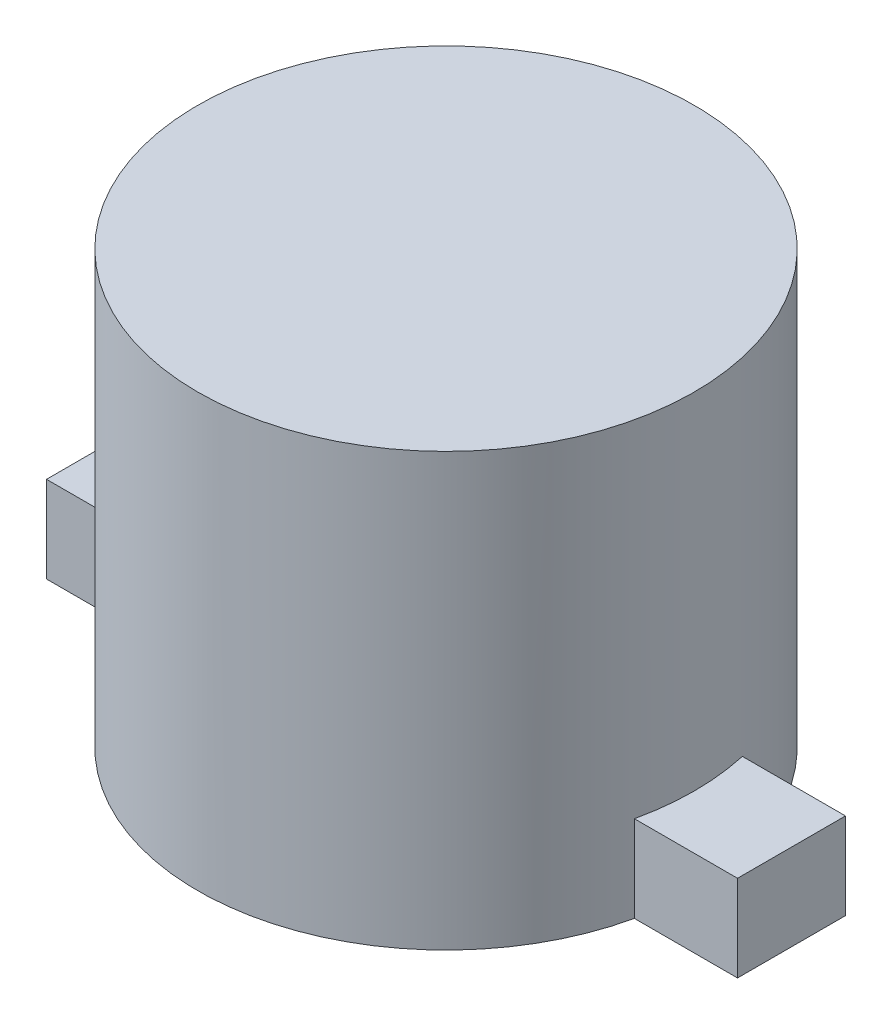
ISO-10303-21;
HEADER;
FILE_DESCRIPTION(('STEP AP214'),'2;1');
FILE_NAME('part.step','',(''),(''),'','','');
FILE_SCHEMA(('AUTOMOTIVE_DESIGN { 1 0 10303 214 1 1 1 1 }'));
ENDSEC;
DATA;
#1=APPLICATION_CONTEXT('core data for automotive mechanical design processes');
#2=APPLICATION_PROTOCOL_DEFINITION('international standard','automotive_design',2000,#1);
#3=PRODUCT_CONTEXT('',#1,'mechanical');
#4=PRODUCT('Part','Part','',(#3));
#5=PRODUCT_RELATED_PRODUCT_CATEGORY('part','',(#4));
#6=PRODUCT_DEFINITION_FORMATION('','',#4);
#7=PRODUCT_DEFINITION_CONTEXT('part definition',#1,'design');
#8=PRODUCT_DEFINITION('design','',#6,#7);
#9=PRODUCT_DEFINITION_SHAPE('','',#8);
#10=(LENGTH_UNIT() NAMED_UNIT(*) SI_UNIT(.MILLI.,.METRE.));
#11=(NAMED_UNIT(*) PLANE_ANGLE_UNIT() SI_UNIT($,.RADIAN.));
#12=(NAMED_UNIT(*) SI_UNIT($,.STERADIAN.) SOLID_ANGLE_UNIT());
#13=UNCERTAINTY_MEASURE_WITH_UNIT(LENGTH_MEASURE(1.E-05),#10,'distance_accuracy_value','');
#14=(GEOMETRIC_REPRESENTATION_CONTEXT(3) GLOBAL_UNCERTAINTY_ASSIGNED_CONTEXT((#13)) GLOBAL_UNIT_ASSIGNED_CONTEXT((#10,
#11,#12)) REPRESENTATION_CONTEXT('',''));
#15=CARTESIAN_POINT('',(0.,0.,0.));
#16=DIRECTION('',(0.,0.,1.));
#17=DIRECTION('',(1.,0.,0.));
#18=AXIS2_PLACEMENT_3D('',#15,#16,#17);
#19=CARTESIAN_POINT('',(0.,10.,0.));
#20=DIRECTION('',(0.,-1.,0.));
#21=DIRECTION('',(0.,0.,-1.));
#22=AXIS2_PLACEMENT_3D('',#19,#20,#21);
#23=CYLINDRICAL_SURFACE('',#22,5.75000000000001);
#24=CARTESIAN_POINT('',(0.,2.,0.));
#25=DIRECTION('',(0.,-1.,0.));
#26=DIRECTION('',(0.,0.,-1.));
#27=AXIS2_PLACEMENT_3D('',#24,#25,#26);
#28=CIRCLE('',#27,5.75000000000001);
#29=CARTESIAN_POINT('',(5.61248608016092,2.,-1.25));
#30=VERTEX_POINT('',#29);
#31=CARTESIAN_POINT('',(5.61248608016092,2.,1.25));
#32=VERTEX_POINT('',#31);
#33=EDGE_CURVE('E11',#30,#32,#28,.T.);
#34=ORIENTED_EDGE('',*,*,#33,.F.);
#35=DIRECTION('',(0.,-1.,0.));
#36=VECTOR('',#35,1.);
#37=CARTESIAN_POINT('',(5.61248608016092,10.,-1.25));
#38=LINE('',#37,#36);
#39=CARTESIAN_POINT('',(5.61248608016092,0.,-1.25));
#40=VERTEX_POINT('',#39);
#41=EDGE_CURVE('E177',#30,#40,#38,.T.);
#42=ORIENTED_EDGE('',*,*,#41,.T.);
#43=CARTESIAN_POINT('',(0.,0.,0.));
#44=DIRECTION('',(0.,1.,0.));
#45=DIRECTION('',(0.,0.,1.));
#46=AXIS2_PLACEMENT_3D('',#43,#44,#45);
#47=CIRCLE('',#46,5.75000000000001);
#48=CARTESIAN_POINT('',(-5.61248608016092,0.,-1.25));
#49=VERTEX_POINT('',#48);
#50=EDGE_CURVE('E184',#40,#49,#47,.T.);
#51=ORIENTED_EDGE('',*,*,#50,.T.);
#52=DIRECTION('',(0.,-1.,0.));
#53=VECTOR('',#52,1.);
#54=CARTESIAN_POINT('',(-5.61248608016092,10.,-1.25));
#55=LINE('',#54,#53);
#56=CARTESIAN_POINT('',(-5.61248608016092,2.,-1.25));
#57=VERTEX_POINT('',#56);
#58=EDGE_CURVE('E174',#49,#57,#55,.F.);
#59=ORIENTED_EDGE('',*,*,#58,.T.);
#60=CARTESIAN_POINT('',(-5.61248608016092,2.,1.25));
#61=VERTEX_POINT('',#60);
#62=EDGE_CURVE('E48',#61,#57,#28,.T.);
#63=ORIENTED_EDGE('',*,*,#62,.F.);
#64=DIRECTION('',(0.,-1.,0.));
#65=VECTOR('',#64,1.);
#66=CARTESIAN_POINT('',(-5.61248608016092,10.,1.25));
#67=LINE('',#66,#65);
#68=CARTESIAN_POINT('',(-5.61248608016092,0.,1.25));
#69=VERTEX_POINT('',#68);
#70=EDGE_CURVE('E170',#61,#69,#67,.T.);
#71=ORIENTED_EDGE('',*,*,#70,.T.);
#72=CARTESIAN_POINT('',(5.61248608016092,0.,1.25));
#73=VERTEX_POINT('',#72);
#74=EDGE_CURVE('E180',#69,#73,#47,.T.);
#75=ORIENTED_EDGE('',*,*,#74,.T.);
#76=DIRECTION('',(0.,-1.,0.));
#77=VECTOR('',#76,1.);
#78=CARTESIAN_POINT('',(5.61248608016092,10.,1.25));
#79=LINE('',#78,#77);
#80=EDGE_CURVE('E60',#73,#32,#79,.F.);
#81=ORIENTED_EDGE('',*,*,#80,.T.);
#82=EDGE_LOOP('',(#34,#42,#51,#59,#63,#71,#75,#81));
#83=FACE_BOUND('',#82,.T.);
#84=CARTESIAN_POINT('',(0.,10.,0.));
#85=DIRECTION('',(0.,1.,0.));
#86=DIRECTION('',(0.,0.,1.));
#87=AXIS2_PLACEMENT_3D('',#84,#85,#86);
#88=CIRCLE('',#87,5.75000000000001);
#89=CARTESIAN_POINT('',(0.,10.,5.75000000000001));
#90=VERTEX_POINT('',#89);
#91=EDGE_CURVE('E181',#90,#90,#88,.T.);
#92=ORIENTED_EDGE('',*,*,#91,.F.);
#93=EDGE_LOOP('',(#92));
#94=FACE_BOUND('',#93,.T.);
#95=ADVANCED_FACE('F45',(#83,#94),#23,.T.);
#96=CARTESIAN_POINT('',(0.,10.,0.));
#97=DIRECTION('',(0.,1.,0.));
#98=DIRECTION('',(0.,0.,1.));
#99=AXIS2_PLACEMENT_3D('',#96,#97,#98);
#100=PLANE('',#99);
#101=ORIENTED_EDGE('',*,*,#91,.T.);
#102=EDGE_LOOP('',(#101));
#103=FACE_BOUND('',#102,.T.);
#104=ADVANCED_FACE('F226',(#103),#100,.T.);
#105=CARTESIAN_POINT('',(0.,0.,0.));
#106=DIRECTION('',(0.,1.,0.));
#107=DIRECTION('',(0.,0.,1.));
#108=AXIS2_PLACEMENT_3D('',#105,#106,#107);
#109=PLANE('',#108);
#110=ORIENTED_EDGE('',*,*,#74,.F.);
#111=DIRECTION('',(-1.,0.,0.));
#112=VECTOR('',#111,1.);
#113=CARTESIAN_POINT('',(-8.,0.,1.25));
#114=LINE('',#113,#112);
#115=CARTESIAN_POINT('',(-8.,0.,1.25));
#116=VERTEX_POINT('',#115);
#117=EDGE_CURVE('E153',#69,#116,#114,.T.);
#118=ORIENTED_EDGE('',*,*,#117,.T.);
#119=DIRECTION('',(0.,0.,-1.));
#120=VECTOR('',#119,1.);
#121=CARTESIAN_POINT('',(-8.,0.,1.25));
#122=LINE('',#121,#120);
#123=CARTESIAN_POINT('',(-8.,0.,-1.25));
#124=VERTEX_POINT('',#123);
#125=EDGE_CURVE('E156',#116,#124,#122,.T.);
#126=ORIENTED_EDGE('',*,*,#125,.T.);
#127=DIRECTION('',(1.,0.,0.));
#128=VECTOR('',#127,1.);
#129=CARTESIAN_POINT('',(-8.,0.,-1.25));
#130=LINE('',#129,#128);
#131=EDGE_CURVE('E135',#124,#49,#130,.T.);
#132=ORIENTED_EDGE('',*,*,#131,.T.);
#133=ORIENTED_EDGE('',*,*,#50,.F.);
#134=CARTESIAN_POINT('',(8.,0.,-1.25));
#135=VERTEX_POINT('',#134);
#136=EDGE_CURVE('E140',#40,#135,#130,.T.);
#137=ORIENTED_EDGE('',*,*,#136,.T.);
#138=DIRECTION('',(0.,0.,1.));
#139=VECTOR('',#138,1.);
#140=CARTESIAN_POINT('',(8.,0.,1.25));
#141=LINE('',#140,#139);
#142=CARTESIAN_POINT('',(8.,0.,1.25));
#143=VERTEX_POINT('',#142);
#144=EDGE_CURVE('E150',#135,#143,#141,.T.);
#145=ORIENTED_EDGE('',*,*,#144,.T.);
#146=EDGE_CURVE('E112',#143,#73,#114,.T.);
#147=ORIENTED_EDGE('',*,*,#146,.T.);
#148=EDGE_LOOP('',(#110,#118,#126,#132,#133,#137,#145,#147));
#149=FACE_BOUND('',#148,.T.);
#150=ADVANCED_FACE('F196',(#149),#109,.F.);
#151=CARTESIAN_POINT('',(-8.,2.,1.25));
#152=DIRECTION('',(-1.,0.,0.));
#153=DIRECTION('',(0.,0.,1.));
#154=AXIS2_PLACEMENT_3D('',#151,#152,#153);
#155=PLANE('',#154);
#156=ORIENTED_EDGE('',*,*,#125,.F.);
#157=DIRECTION('',(0.,-1.,0.));
#158=VECTOR('',#157,1.);
#159=CARTESIAN_POINT('',(-8.,2.,1.25));
#160=LINE('',#159,#158);
#161=CARTESIAN_POINT('',(-8.,2.,1.25));
#162=VERTEX_POINT('',#161);
#163=EDGE_CURVE('E118',#162,#116,#160,.T.);
#164=ORIENTED_EDGE('',*,*,#163,.F.);
#165=DIRECTION('',(0.,0.,-1.));
#166=VECTOR('',#165,1.);
#167=CARTESIAN_POINT('',(-8.,2.,1.25));
#168=LINE('',#167,#166);
#169=CARTESIAN_POINT('',(-8.,2.,-1.25));
#170=VERTEX_POINT('',#169);
#171=EDGE_CURVE('E127',#162,#170,#168,.T.);
#172=ORIENTED_EDGE('',*,*,#171,.T.);
#173=DIRECTION('',(0.,-1.,0.));
#174=VECTOR('',#173,1.);
#175=CARTESIAN_POINT('',(-8.,2.,-1.25));
#176=LINE('',#175,#174);
#177=EDGE_CURVE('E162',#170,#124,#176,.T.);
#178=ORIENTED_EDGE('',*,*,#177,.T.);
#179=EDGE_LOOP('',(#156,#164,#172,#178));
#180=FACE_BOUND('',#179,.T.);
#181=ADVANCED_FACE('F201',(#180),#155,.T.);
#182=CARTESIAN_POINT('',(0.,2.,0.));
#183=DIRECTION('',(0.,-1.,0.));
#184=DIRECTION('',(0.,0.,-1.));
#185=AXIS2_PLACEMENT_3D('',#182,#183,#184);
#186=PLANE('',#185);
#187=DIRECTION('',(-1.,0.,0.));
#188=VECTOR('',#187,1.);
#189=CARTESIAN_POINT('',(-8.,2.,1.25));
#190=LINE('',#189,#188);
#191=EDGE_CURVE('E128',#61,#162,#190,.T.);
#192=ORIENTED_EDGE('',*,*,#191,.F.);
#193=ORIENTED_EDGE('',*,*,#62,.T.);
#194=DIRECTION('',(1.,0.,0.));
#195=VECTOR('',#194,1.);
#196=CARTESIAN_POINT('',(-8.,2.,-1.25));
#197=LINE('',#196,#195);
#198=EDGE_CURVE('E119',#170,#57,#197,.T.);
#199=ORIENTED_EDGE('',*,*,#198,.F.);
#200=ORIENTED_EDGE('',*,*,#171,.F.);
#201=EDGE_LOOP('',(#192,#193,#199,#200));
#202=FACE_BOUND('',#201,.T.);
#203=ADVANCED_FACE('F205',(#202),#186,.F.);
#204=CARTESIAN_POINT('',(-8.,2.,1.25));
#205=DIRECTION('',(0.,0.,1.));
#206=DIRECTION('',(1.,0.,0.));
#207=AXIS2_PLACEMENT_3D('',#204,#205,#206);
#208=PLANE('',#207);
#209=ORIENTED_EDGE('',*,*,#70,.F.);
#210=ORIENTED_EDGE('',*,*,#191,.T.);
#211=ORIENTED_EDGE('',*,*,#163,.T.);
#212=ORIENTED_EDGE('',*,*,#117,.F.);
#213=EDGE_LOOP('',(#209,#210,#211,#212));
#214=FACE_BOUND('',#213,.T.);
#215=ADVANCED_FACE('F209',(#214),#208,.T.);
#216=CARTESIAN_POINT('',(-8.,2.,-1.25));
#217=DIRECTION('',(0.,0.,-1.));
#218=DIRECTION('',(-1.,0.,0.));
#219=AXIS2_PLACEMENT_3D('',#216,#217,#218);
#220=PLANE('',#219);
#221=ORIENTED_EDGE('',*,*,#58,.F.);
#222=ORIENTED_EDGE('',*,*,#131,.F.);
#223=ORIENTED_EDGE('',*,*,#177,.F.);
#224=ORIENTED_EDGE('',*,*,#198,.T.);
#225=EDGE_LOOP('',(#221,#222,#223,#224));
#226=FACE_BOUND('',#225,.T.);
#227=ADVANCED_FACE('F194',(#226),#220,.T.);
#228=CARTESIAN_POINT('',(8.,2.,-1.25));
#229=VERTEX_POINT('',#228);
#230=EDGE_CURVE('E146',#30,#229,#197,.T.);
#231=ORIENTED_EDGE('',*,*,#230,.F.);
#232=ORIENTED_EDGE('',*,*,#33,.T.);
#233=CARTESIAN_POINT('',(8.,2.,1.25));
#234=VERTEX_POINT('',#233);
#235=EDGE_CURVE('E110',#234,#32,#190,.T.);
#236=ORIENTED_EDGE('',*,*,#235,.F.);
#237=DIRECTION('',(0.,0.,1.));
#238=VECTOR('',#237,1.);
#239=CARTESIAN_POINT('',(8.,2.,1.25));
#240=LINE('',#239,#238);
#241=EDGE_CURVE('E125',#229,#234,#240,.T.);
#242=ORIENTED_EDGE('',*,*,#241,.F.);
#243=EDGE_LOOP('',(#231,#232,#236,#242));
#244=FACE_BOUND('',#243,.T.);
#245=ADVANCED_FACE('F124',(#244),#186,.F.);
#246=ORIENTED_EDGE('',*,*,#41,.F.);
#247=ORIENTED_EDGE('',*,*,#230,.T.);
#248=DIRECTION('',(0.,-1.,0.));
#249=VECTOR('',#248,1.);
#250=CARTESIAN_POINT('',(8.,2.,-1.25));
#251=LINE('',#250,#249);
#252=EDGE_CURVE('E133',#229,#135,#251,.T.);
#253=ORIENTED_EDGE('',*,*,#252,.T.);
#254=ORIENTED_EDGE('',*,*,#136,.F.);
#255=EDGE_LOOP('',(#246,#247,#253,#254));
#256=FACE_BOUND('',#255,.T.);
#257=ADVANCED_FACE('F213',(#256),#220,.T.);
#258=ORIENTED_EDGE('',*,*,#80,.F.);
#259=ORIENTED_EDGE('',*,*,#146,.F.);
#260=DIRECTION('',(0.,-1.,0.));
#261=VECTOR('',#260,1.);
#262=CARTESIAN_POINT('',(8.,2.,1.25));
#263=LINE('',#262,#261);
#264=EDGE_CURVE('E107',#234,#143,#263,.T.);
#265=ORIENTED_EDGE('',*,*,#264,.F.);
#266=ORIENTED_EDGE('',*,*,#235,.T.);
#267=EDGE_LOOP('',(#258,#259,#265,#266));
#268=FACE_BOUND('',#267,.T.);
#269=ADVANCED_FACE('F109',(#268),#208,.T.);
#270=CARTESIAN_POINT('',(8.,2.,1.25));
#271=DIRECTION('',(1.,0.,0.));
#272=DIRECTION('',(0.,0.,-1.));
#273=AXIS2_PLACEMENT_3D('',#270,#271,#272);
#274=PLANE('',#273);
#275=ORIENTED_EDGE('',*,*,#144,.F.);
#276=ORIENTED_EDGE('',*,*,#252,.F.);
#277=ORIENTED_EDGE('',*,*,#241,.T.);
#278=ORIENTED_EDGE('',*,*,#264,.T.);
#279=EDGE_LOOP('',(#275,#276,#277,#278));
#280=FACE_BOUND('',#279,.T.);
#281=ADVANCED_FACE('F131',(#280),#274,.T.);
#282=CLOSED_SHELL('',(#95,#104,#150,#181,#203,#215,#227,#245,#257,#269,#281));
#283=MANIFOLD_SOLID_BREP('B2',#282);
#284=ADVANCED_BREP_SHAPE_REPRESENTATION('',(#18,#283),#14);
#285=SHAPE_DEFINITION_REPRESENTATION(#9,#284);
ENDSEC;
END-ISO-10303-21;
